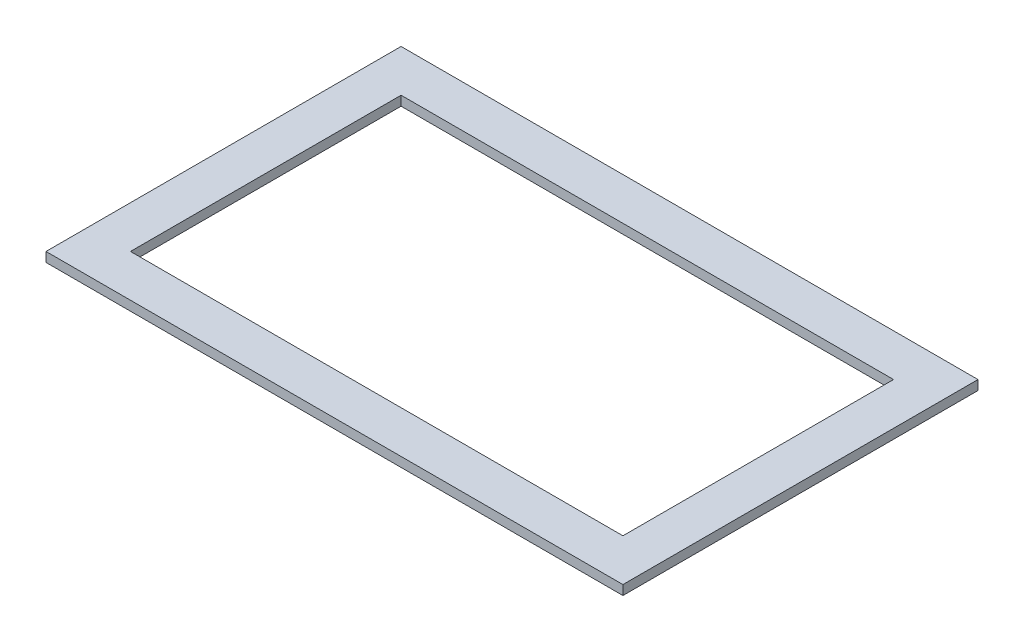
ISO-10303-21;
HEADER;
FILE_DESCRIPTION(('STEP AP214'),'2;1');
FILE_NAME('part.step','',(''),(''),'','','');
FILE_SCHEMA(('AUTOMOTIVE_DESIGN { 1 0 10303 214 1 1 1 1 }'));
ENDSEC;
DATA;
#1=APPLICATION_CONTEXT('core data for automotive mechanical design processes');
#2=APPLICATION_PROTOCOL_DEFINITION('international standard','automotive_design',2000,#1);
#3=PRODUCT_CONTEXT('',#1,'mechanical');
#4=PRODUCT('Part','Part','',(#3));
#5=PRODUCT_RELATED_PRODUCT_CATEGORY('part','',(#4));
#6=PRODUCT_DEFINITION_FORMATION('','',#4);
#7=PRODUCT_DEFINITION_CONTEXT('part definition',#1,'design');
#8=PRODUCT_DEFINITION('design','',#6,#7);
#9=PRODUCT_DEFINITION_SHAPE('','',#8);
#10=(LENGTH_UNIT() NAMED_UNIT(*) SI_UNIT(.MILLI.,.METRE.));
#11=(NAMED_UNIT(*) PLANE_ANGLE_UNIT() SI_UNIT($,.RADIAN.));
#12=(NAMED_UNIT(*) SI_UNIT($,.STERADIAN.) SOLID_ANGLE_UNIT());
#13=UNCERTAINTY_MEASURE_WITH_UNIT(LENGTH_MEASURE(1.E-05),#10,'distance_accuracy_value','');
#14=(GEOMETRIC_REPRESENTATION_CONTEXT(3) GLOBAL_UNCERTAINTY_ASSIGNED_CONTEXT((#13)) GLOBAL_UNIT_ASSIGNED_CONTEXT((#10,
#11,#12)) REPRESENTATION_CONTEXT('',''));
#15=CARTESIAN_POINT('',(0.,0.,0.));
#16=DIRECTION('',(0.,0.,1.));
#17=DIRECTION('',(1.,0.,0.));
#18=AXIS2_PLACEMENT_3D('',#15,#16,#17);
#19=CARTESIAN_POINT('',(0.,2.,0.));
#20=DIRECTION('',(0.,-1.,0.));
#21=DIRECTION('',(0.,0.,-1.));
#22=AXIS2_PLACEMENT_3D('',#19,#20,#21);
#23=PLANE('',#22);
#24=DIRECTION('',(0.,0.,-1.));
#25=VECTOR('',#24,1.);
#26=CARTESIAN_POINT('',(60.5096635260019,2.,37.2415145618795));
#27=LINE('',#26,#25);
#28=CARTESIAN_POINT('',(60.5096635260019,2.,37.2415145618795));
#29=VERTEX_POINT('',#28);
#30=CARTESIAN_POINT('',(60.5096635260019,2.,-37.2415145618795));
#31=VERTEX_POINT('',#30);
#32=EDGE_CURVE('E134',#29,#31,#27,.T.);
#33=ORIENTED_EDGE('',*,*,#32,.T.);
#34=DIRECTION('',(-1.,0.,0.));
#35=VECTOR('',#34,1.);
#36=CARTESIAN_POINT('',(-60.5096635260019,2.,-37.2415145618795));
#37=LINE('',#36,#35);
#38=CARTESIAN_POINT('',(-60.5096635260019,2.,-37.2415145618795));
#39=VERTEX_POINT('',#38);
#40=EDGE_CURVE('E137',#31,#39,#37,.T.);
#41=ORIENTED_EDGE('',*,*,#40,.T.);
#42=DIRECTION('',(0.,0.,1.));
#43=VECTOR('',#42,1.);
#44=CARTESIAN_POINT('',(-60.5096635260019,2.,37.2415145618795));
#45=LINE('',#44,#43);
#46=CARTESIAN_POINT('',(-60.5096635260019,2.,37.2415145618795));
#47=VERTEX_POINT('',#46);
#48=EDGE_CURVE('E140',#39,#47,#45,.T.);
#49=ORIENTED_EDGE('',*,*,#48,.T.);
#50=DIRECTION('',(1.,0.,0.));
#51=VECTOR('',#50,1.);
#52=CARTESIAN_POINT('',(-60.5096635260019,2.,37.2415145618795));
#53=LINE('',#52,#51);
#54=EDGE_CURVE('E142',#47,#29,#53,.T.);
#55=ORIENTED_EDGE('',*,*,#54,.T.);
#56=EDGE_LOOP('',(#33,#41,#49,#55));
#57=FACE_BOUND('',#56,.T.);
#58=DIRECTION('',(0.,0.,-1.));
#59=VECTOR('',#58,1.);
#60=CARTESIAN_POINT('',(51.6515478345665,2.,28.3833988704442));
#61=LINE('',#60,#59);
#62=CARTESIAN_POINT('',(51.6515478345665,2.,28.3833988704442));
#63=VERTEX_POINT('',#62);
#64=CARTESIAN_POINT('',(51.6515478345665,2.,-28.3833988704442));
#65=VERTEX_POINT('',#64);
#66=EDGE_CURVE('E98',#63,#65,#61,.T.);
#67=ORIENTED_EDGE('',*,*,#66,.F.);
#68=DIRECTION('',(1.,0.,0.));
#69=VECTOR('',#68,1.);
#70=CARTESIAN_POINT('',(-51.6515478345665,2.,28.3833988704442));
#71=LINE('',#70,#69);
#72=CARTESIAN_POINT('',(-51.6515478345665,2.,28.3833988704442));
#73=VERTEX_POINT('',#72);
#74=EDGE_CURVE('E120',#73,#63,#71,.T.);
#75=ORIENTED_EDGE('',*,*,#74,.F.);
#76=DIRECTION('',(0.,0.,1.));
#77=VECTOR('',#76,1.);
#78=CARTESIAN_POINT('',(-51.6515478345665,2.,28.3833988704442));
#79=LINE('',#78,#77);
#80=CARTESIAN_POINT('',(-51.6515478345665,2.,-28.3833988704442));
#81=VERTEX_POINT('',#80);
#82=EDGE_CURVE('E118',#81,#73,#79,.T.);
#83=ORIENTED_EDGE('',*,*,#82,.F.);
#84=DIRECTION('',(-1.,0.,0.));
#85=VECTOR('',#84,1.);
#86=CARTESIAN_POINT('',(-51.6515478345665,2.,-28.3833988704442));
#87=LINE('',#86,#85);
#88=EDGE_CURVE('E106',#65,#81,#87,.T.);
#89=ORIENTED_EDGE('',*,*,#88,.F.);
#90=EDGE_LOOP('',(#67,#75,#83,#89));
#91=FACE_BOUND('',#90,.T.);
#92=ADVANCED_FACE('F33',(#57,#91),#23,.F.);
#93=CARTESIAN_POINT('',(0.,0.,0.));
#94=DIRECTION('',(0.,-1.,0.));
#95=DIRECTION('',(0.,0.,-1.));
#96=AXIS2_PLACEMENT_3D('',#93,#94,#95);
#97=PLANE('',#96);
#98=DIRECTION('',(0.,0.,-1.));
#99=VECTOR('',#98,1.);
#100=CARTESIAN_POINT('',(60.5096635260019,0.,37.2415145618795));
#101=LINE('',#100,#99);
#102=CARTESIAN_POINT('',(60.5096635260019,0.,37.2415145618795));
#103=VERTEX_POINT('',#102);
#104=CARTESIAN_POINT('',(60.5096635260019,0.,-37.2415145618795));
#105=VERTEX_POINT('',#104);
#106=EDGE_CURVE('E114',#103,#105,#101,.T.);
#107=ORIENTED_EDGE('',*,*,#106,.F.);
#108=DIRECTION('',(1.,0.,0.));
#109=VECTOR('',#108,1.);
#110=CARTESIAN_POINT('',(-60.5096635260019,0.,37.2415145618795));
#111=LINE('',#110,#109);
#112=CARTESIAN_POINT('',(-60.5096635260019,0.,37.2415145618795));
#113=VERTEX_POINT('',#112);
#114=EDGE_CURVE('E138',#113,#103,#111,.T.);
#115=ORIENTED_EDGE('',*,*,#114,.F.);
#116=DIRECTION('',(0.,0.,1.));
#117=VECTOR('',#116,1.);
#118=CARTESIAN_POINT('',(-60.5096635260019,0.,37.2415145618795));
#119=LINE('',#118,#117);
#120=CARTESIAN_POINT('',(-60.5096635260019,0.,-37.2415145618795));
#121=VERTEX_POINT('',#120);
#122=EDGE_CURVE('E149',#121,#113,#119,.T.);
#123=ORIENTED_EDGE('',*,*,#122,.F.);
#124=DIRECTION('',(-1.,0.,0.));
#125=VECTOR('',#124,1.);
#126=CARTESIAN_POINT('',(-60.5096635260019,0.,-37.2415145618795));
#127=LINE('',#126,#125);
#128=EDGE_CURVE('E147',#105,#121,#127,.T.);
#129=ORIENTED_EDGE('',*,*,#128,.F.);
#130=EDGE_LOOP('',(#107,#115,#123,#129));
#131=FACE_BOUND('',#130,.T.);
#132=DIRECTION('',(1.,0.,0.));
#133=VECTOR('',#132,1.);
#134=CARTESIAN_POINT('',(-51.6515478345665,0.,28.3833988704442));
#135=LINE('',#134,#133);
#136=CARTESIAN_POINT('',(-51.6515478345665,0.,28.3833988704442));
#137=VERTEX_POINT('',#136);
#138=CARTESIAN_POINT('',(51.6515478345665,0.,28.3833988704442));
#139=VERTEX_POINT('',#138);
#140=EDGE_CURVE('E107',#137,#139,#135,.T.);
#141=ORIENTED_EDGE('',*,*,#140,.T.);
#142=DIRECTION('',(0.,0.,-1.));
#143=VECTOR('',#142,1.);
#144=CARTESIAN_POINT('',(51.6515478345665,0.,28.3833988704442));
#145=LINE('',#144,#143);
#146=CARTESIAN_POINT('',(51.6515478345665,0.,-28.3833988704442));
#147=VERTEX_POINT('',#146);
#148=EDGE_CURVE('E56',#139,#147,#145,.T.);
#149=ORIENTED_EDGE('',*,*,#148,.T.);
#150=DIRECTION('',(-1.,0.,0.));
#151=VECTOR('',#150,1.);
#152=CARTESIAN_POINT('',(-51.6515478345665,0.,-28.3833988704442));
#153=LINE('',#152,#151);
#154=CARTESIAN_POINT('',(-51.6515478345665,0.,-28.3833988704442));
#155=VERTEX_POINT('',#154);
#156=EDGE_CURVE('E113',#147,#155,#153,.T.);
#157=ORIENTED_EDGE('',*,*,#156,.T.);
#158=DIRECTION('',(0.,0.,1.));
#159=VECTOR('',#158,1.);
#160=CARTESIAN_POINT('',(-51.6515478345665,0.,28.3833988704442));
#161=LINE('',#160,#159);
#162=EDGE_CURVE('E126',#155,#137,#161,.T.);
#163=ORIENTED_EDGE('',*,*,#162,.T.);
#164=EDGE_LOOP('',(#141,#149,#157,#163));
#165=FACE_BOUND('',#164,.T.);
#166=ADVANCED_FACE('F167',(#131,#165),#97,.T.);
#167=CARTESIAN_POINT('',(60.5096635260019,2.,37.2415145618795));
#168=DIRECTION('',(-1.,0.,0.));
#169=DIRECTION('',(0.,0.,1.));
#170=AXIS2_PLACEMENT_3D('',#167,#168,#169);
#171=PLANE('',#170);
#172=ORIENTED_EDGE('',*,*,#106,.T.);
#173=DIRECTION('',(0.,-1.,0.));
#174=VECTOR('',#173,1.);
#175=CARTESIAN_POINT('',(60.5096635260019,2.,-37.2415145618795));
#176=LINE('',#175,#174);
#177=EDGE_CURVE('E11',#31,#105,#176,.T.);
#178=ORIENTED_EDGE('',*,*,#177,.F.);
#179=ORIENTED_EDGE('',*,*,#32,.F.);
#180=DIRECTION('',(0.,-1.,0.));
#181=VECTOR('',#180,1.);
#182=CARTESIAN_POINT('',(60.5096635260019,2.,37.2415145618795));
#183=LINE('',#182,#181);
#184=EDGE_CURVE('E144',#29,#103,#183,.T.);
#185=ORIENTED_EDGE('',*,*,#184,.T.);
#186=EDGE_LOOP('',(#172,#178,#179,#185));
#187=FACE_BOUND('',#186,.T.);
#188=ADVANCED_FACE('F35',(#187),#171,.F.);
#189=CARTESIAN_POINT('',(-60.5096635260019,2.,-37.2415145618795));
#190=DIRECTION('',(0.,0.,1.));
#191=DIRECTION('',(1.,0.,0.));
#192=AXIS2_PLACEMENT_3D('',#189,#190,#191);
#193=PLANE('',#192);
#194=ORIENTED_EDGE('',*,*,#128,.T.);
#195=DIRECTION('',(0.,-1.,0.));
#196=VECTOR('',#195,1.);
#197=CARTESIAN_POINT('',(-60.5096635260019,2.,-37.2415145618795));
#198=LINE('',#197,#196);
#199=EDGE_CURVE('E41',#39,#121,#198,.T.);
#200=ORIENTED_EDGE('',*,*,#199,.F.);
#201=ORIENTED_EDGE('',*,*,#40,.F.);
#202=ORIENTED_EDGE('',*,*,#177,.T.);
#203=EDGE_LOOP('',(#194,#200,#201,#202));
#204=FACE_BOUND('',#203,.T.);
#205=ADVANCED_FACE('F177',(#204),#193,.F.);
#206=CARTESIAN_POINT('',(-60.5096635260019,2.,37.2415145618795));
#207=DIRECTION('',(1.,0.,0.));
#208=DIRECTION('',(0.,0.,-1.));
#209=AXIS2_PLACEMENT_3D('',#206,#207,#208);
#210=PLANE('',#209);
#211=ORIENTED_EDGE('',*,*,#122,.T.);
#212=DIRECTION('',(0.,-1.,0.));
#213=VECTOR('',#212,1.);
#214=CARTESIAN_POINT('',(-60.5096635260019,2.,37.2415145618795));
#215=LINE('',#214,#213);
#216=EDGE_CURVE('E154',#47,#113,#215,.T.);
#217=ORIENTED_EDGE('',*,*,#216,.F.);
#218=ORIENTED_EDGE('',*,*,#48,.F.);
#219=ORIENTED_EDGE('',*,*,#199,.T.);
#220=EDGE_LOOP('',(#211,#217,#218,#219));
#221=FACE_BOUND('',#220,.T.);
#222=ADVANCED_FACE('F161',(#221),#210,.F.);
#223=CARTESIAN_POINT('',(-60.5096635260019,2.,37.2415145618795));
#224=DIRECTION('',(0.,0.,-1.));
#225=DIRECTION('',(-1.,0.,0.));
#226=AXIS2_PLACEMENT_3D('',#223,#224,#225);
#227=PLANE('',#226);
#228=ORIENTED_EDGE('',*,*,#114,.T.);
#229=ORIENTED_EDGE('',*,*,#184,.F.);
#230=ORIENTED_EDGE('',*,*,#54,.F.);
#231=ORIENTED_EDGE('',*,*,#216,.T.);
#232=EDGE_LOOP('',(#228,#229,#230,#231));
#233=FACE_BOUND('',#232,.T.);
#234=ADVANCED_FACE('F171',(#233),#227,.F.);
#235=CARTESIAN_POINT('',(51.6515478345665,2.,28.3833988704442));
#236=DIRECTION('',(-1.,0.,0.));
#237=DIRECTION('',(0.,0.,1.));
#238=AXIS2_PLACEMENT_3D('',#235,#236,#237);
#239=PLANE('',#238);
#240=ORIENTED_EDGE('',*,*,#148,.F.);
#241=DIRECTION('',(0.,-1.,0.));
#242=VECTOR('',#241,1.);
#243=CARTESIAN_POINT('',(51.6515478345665,2.,28.3833988704442));
#244=LINE('',#243,#242);
#245=EDGE_CURVE('E102',#63,#139,#244,.T.);
#246=ORIENTED_EDGE('',*,*,#245,.F.);
#247=ORIENTED_EDGE('',*,*,#66,.T.);
#248=DIRECTION('',(0.,-1.,0.));
#249=VECTOR('',#248,1.);
#250=CARTESIAN_POINT('',(51.6515478345665,2.,-28.3833988704442));
#251=LINE('',#250,#249);
#252=EDGE_CURVE('E101',#65,#147,#251,.T.);
#253=ORIENTED_EDGE('',*,*,#252,.T.);
#254=EDGE_LOOP('',(#240,#246,#247,#253));
#255=FACE_BOUND('',#254,.T.);
#256=ADVANCED_FACE('F100',(#255),#239,.T.);
#257=CARTESIAN_POINT('',(-51.6515478345665,2.,-28.3833988704442));
#258=DIRECTION('',(0.,0.,1.));
#259=DIRECTION('',(1.,0.,0.));
#260=AXIS2_PLACEMENT_3D('',#257,#258,#259);
#261=PLANE('',#260);
#262=ORIENTED_EDGE('',*,*,#156,.F.);
#263=ORIENTED_EDGE('',*,*,#252,.F.);
#264=ORIENTED_EDGE('',*,*,#88,.T.);
#265=DIRECTION('',(0.,-1.,0.));
#266=VECTOR('',#265,1.);
#267=CARTESIAN_POINT('',(-51.6515478345665,2.,-28.3833988704442));
#268=LINE('',#267,#266);
#269=EDGE_CURVE('E115',#81,#155,#268,.T.);
#270=ORIENTED_EDGE('',*,*,#269,.T.);
#271=EDGE_LOOP('',(#262,#263,#264,#270));
#272=FACE_BOUND('',#271,.T.);
#273=ADVANCED_FACE('F110',(#272),#261,.T.);
#274=CARTESIAN_POINT('',(-51.6515478345665,2.,28.3833988704442));
#275=DIRECTION('',(1.,0.,0.));
#276=DIRECTION('',(0.,0.,-1.));
#277=AXIS2_PLACEMENT_3D('',#274,#275,#276);
#278=PLANE('',#277);
#279=ORIENTED_EDGE('',*,*,#162,.F.);
#280=ORIENTED_EDGE('',*,*,#269,.F.);
#281=ORIENTED_EDGE('',*,*,#82,.T.);
#282=DIRECTION('',(0.,-1.,0.));
#283=VECTOR('',#282,1.);
#284=CARTESIAN_POINT('',(-51.6515478345665,2.,28.3833988704442));
#285=LINE('',#284,#283);
#286=EDGE_CURVE('E48',#73,#137,#285,.T.);
#287=ORIENTED_EDGE('',*,*,#286,.T.);
#288=EDGE_LOOP('',(#279,#280,#281,#287));
#289=FACE_BOUND('',#288,.T.);
#290=ADVANCED_FACE('F200',(#289),#278,.T.);
#291=CARTESIAN_POINT('',(-51.6515478345665,2.,28.3833988704442));
#292=DIRECTION('',(0.,0.,-1.));
#293=DIRECTION('',(-1.,0.,0.));
#294=AXIS2_PLACEMENT_3D('',#291,#292,#293);
#295=PLANE('',#294);
#296=ORIENTED_EDGE('',*,*,#140,.F.);
#297=ORIENTED_EDGE('',*,*,#286,.F.);
#298=ORIENTED_EDGE('',*,*,#74,.T.);
#299=ORIENTED_EDGE('',*,*,#245,.T.);
#300=EDGE_LOOP('',(#296,#297,#298,#299));
#301=FACE_BOUND('',#300,.T.);
#302=ADVANCED_FACE('F204',(#301),#295,.T.);
#303=CLOSED_SHELL('',(#92,#166,#188,#205,#222,#234,#256,#273,#290,#302));
#304=MANIFOLD_SOLID_BREP('B2',#303);
#305=ADVANCED_BREP_SHAPE_REPRESENTATION('',(#18,#304),#14);
#306=SHAPE_DEFINITION_REPRESENTATION(#9,#305);
ENDSEC;
END-ISO-10303-21;
